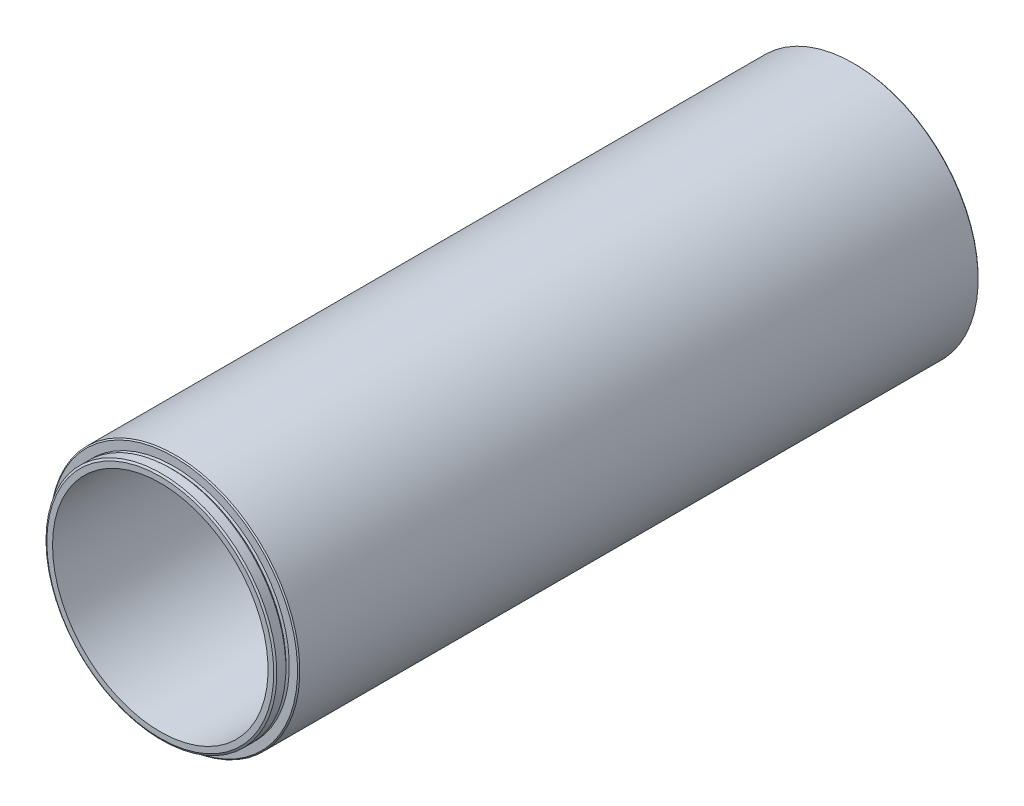
ISO-10303-21;
HEADER;
FILE_DESCRIPTION(('STEP AP214'),'2;1');
FILE_NAME('part.step','',(''),(''),'','','');
FILE_SCHEMA(('AUTOMOTIVE_DESIGN { 1 0 10303 214 1 1 1 1 }'));
ENDSEC;
DATA;
#1=APPLICATION_CONTEXT('core data for automotive mechanical design processes');
#2=APPLICATION_PROTOCOL_DEFINITION('international standard','automotive_design',2000,#1);
#3=PRODUCT_CONTEXT('',#1,'mechanical');
#4=PRODUCT('Part','Part','',(#3));
#5=PRODUCT_RELATED_PRODUCT_CATEGORY('part','',(#4));
#6=PRODUCT_DEFINITION_FORMATION('','',#4);
#7=PRODUCT_DEFINITION_CONTEXT('part definition',#1,'design');
#8=PRODUCT_DEFINITION('design','',#6,#7);
#9=PRODUCT_DEFINITION_SHAPE('','',#8);
#10=(LENGTH_UNIT() NAMED_UNIT(*) SI_UNIT(.MILLI.,.METRE.));
#11=(NAMED_UNIT(*) PLANE_ANGLE_UNIT() SI_UNIT($,.RADIAN.));
#12=(NAMED_UNIT(*) SI_UNIT($,.STERADIAN.) SOLID_ANGLE_UNIT());
#13=UNCERTAINTY_MEASURE_WITH_UNIT(LENGTH_MEASURE(1.E-05),#10,'distance_accuracy_value','');
#14=(GEOMETRIC_REPRESENTATION_CONTEXT(3) GLOBAL_UNCERTAINTY_ASSIGNED_CONTEXT((#13)) GLOBAL_UNIT_ASSIGNED_CONTEXT((#10,
#11,#12)) REPRESENTATION_CONTEXT('',''));
#15=CARTESIAN_POINT('',(0.,0.,0.));
#16=DIRECTION('',(0.,0.,1.));
#17=DIRECTION('',(1.,0.,0.));
#18=AXIS2_PLACEMENT_3D('',#15,#16,#17);
#19=CARTESIAN_POINT('',(-66.2576521581855,-31.9245145395257,134.37630402218));
#20=DIRECTION('',(0.,0.,-1.));
#21=DIRECTION('',(-1.,0.,0.));
#22=AXIS2_PLACEMENT_3D('',#19,#20,#21);
#23=CYLINDRICAL_SURFACE('',#22,25.8445);
#24=CARTESIAN_POINT('',(-66.2576521581855,-31.9245145395257,134.12230402218));
#25=DIRECTION('',(0.,0.,-1.));
#26=DIRECTION('',(-1.,0.,0.));
#27=AXIS2_PLACEMENT_3D('',#24,#25,#26);
#28=CIRCLE('',#27,25.8445);
#29=CARTESIAN_POINT('',(-92.1021521581855,-31.9245145395257,134.12230402218));
#30=VERTEX_POINT('',#29);
#31=EDGE_CURVE('P0_E10',#30,#30,#28,.T.);
#32=ORIENTED_EDGE('',*,*,#31,.T.);
#33=EDGE_LOOP('',(#32));
#34=FACE_BOUND('',#33,.T.);
#35=CARTESIAN_POINT('',(-66.2576521581855,-31.9245145395257,132.09030402218));
#36=DIRECTION('',(0.,0.,-1.));
#37=DIRECTION('',(-1.,0.,0.));
#38=AXIS2_PLACEMENT_3D('',#35,#36,#37);
#39=CIRCLE('',#38,25.8445);
#40=CARTESIAN_POINT('',(-92.1021521581855,-31.9245145395257,132.09030402218));
#41=VERTEX_POINT('',#40);
#42=EDGE_CURVE('P0_E80',#41,#41,#39,.T.);
#43=ORIENTED_EDGE('',*,*,#42,.F.);
#44=EDGE_LOOP('',(#43));
#45=FACE_BOUND('',#44,.T.);
#46=ADVANCED_FACE('P0_F31',(#34,#45),#23,.T.);
#47=CARTESIAN_POINT('',(-66.2576521581855,-31.9245145395257,134.12230402218));
#48=DIRECTION('',(0.,0.,-1.));
#49=DIRECTION('',(-1.,0.,0.));
#50=AXIS2_PLACEMENT_3D('',#47,#48,#49);
#51=CONICAL_SURFACE('',#50,25.8445,1.04719755119661);
#52=CARTESIAN_POINT('',(-66.2576521581855,-31.9245145395257,134.37630402218));
#53=DIRECTION('',(0.,0.,-1.));
#54=DIRECTION('',(-1.,0.,0.));
#55=AXIS2_PLACEMENT_3D('',#52,#53,#54);
#56=CIRCLE('',#55,25.4045590948775);
#57=CARTESIAN_POINT('',(-91.6622112530629,-31.9245145395257,134.37630402218));
#58=VERTEX_POINT('',#57);
#59=EDGE_CURVE('P0_E37',#58,#58,#56,.T.);
#60=ORIENTED_EDGE('',*,*,#59,.T.);
#61=EDGE_LOOP('',(#60));
#62=FACE_BOUND('',#61,.T.);
#63=ORIENTED_EDGE('',*,*,#31,.F.);
#64=EDGE_LOOP('',(#63));
#65=FACE_BOUND('',#64,.T.);
#66=ADVANCED_FACE('P0_F88',(#62,#65),#51,.T.);
#67=CARTESIAN_POINT('',(-40.853093063308,-31.9245145395257,134.37630402218));
#68=DIRECTION('',(0.,0.,1.));
#69=DIRECTION('',(1.,0.,0.));
#70=AXIS2_PLACEMENT_3D('',#67,#68,#69);
#71=PLANE('',#70);
#72=CARTESIAN_POINT('',(-66.2576521581855,-31.9245145395257,134.37630402218));
#73=DIRECTION('',(0.,0.,-1.));
#74=DIRECTION('',(-1.,0.,0.));
#75=AXIS2_PLACEMENT_3D('',#72,#73,#74);
#76=CIRCLE('',#75,24.13);
#77=CARTESIAN_POINT('',(-90.3876521581855,-31.9245145395257,134.37630402218));
#78=VERTEX_POINT('',#77);
#79=EDGE_CURVE('P0_E41',#78,#78,#76,.T.);
#80=ORIENTED_EDGE('',*,*,#79,.T.);
#81=EDGE_LOOP('',(#80));
#82=FACE_BOUND('',#81,.T.);
#83=ORIENTED_EDGE('',*,*,#59,.F.);
#84=EDGE_LOOP('',(#83));
#85=FACE_BOUND('',#84,.T.);
#86=ADVANCED_FACE('P0_F92',(#82,#85),#71,.T.);
#87=CARTESIAN_POINT('',(-66.2576521581855,-31.9245145395257,134.37630402218));
#88=DIRECTION('',(0.,0.,-1.));
#89=DIRECTION('',(-1.,0.,0.));
#90=AXIS2_PLACEMENT_3D('',#87,#88,#89);
#91=CYLINDRICAL_SURFACE('',#90,24.13);
#92=CARTESIAN_POINT('',(-66.2576521581855,-31.9245145395257,4.3283040221796));
#93=DIRECTION('',(0.,0.,-1.));
#94=DIRECTION('',(-1.,0.,0.));
#95=AXIS2_PLACEMENT_3D('',#92,#93,#94);
#96=CIRCLE('',#95,24.13);
#97=CARTESIAN_POINT('',(-90.3876521581855,-31.9245145395257,4.3283040221796));
#98=VERTEX_POINT('',#97);
#99=EDGE_CURVE('P0_E45',#98,#98,#96,.T.);
#100=ORIENTED_EDGE('',*,*,#99,.T.);
#101=EDGE_LOOP('',(#100));
#102=FACE_BOUND('',#101,.T.);
#103=ORIENTED_EDGE('',*,*,#79,.F.);
#104=EDGE_LOOP('',(#103));
#105=FACE_BOUND('',#104,.T.);
#106=ADVANCED_FACE('P0_F96',(#102,#105),#91,.F.);
#107=CARTESIAN_POINT('',(-42.1276521581855,-31.9245145395257,4.32830402217959));
#108=DIRECTION('',(0.,0.,-1.));
#109=DIRECTION('',(-1.,0.,0.));
#110=AXIS2_PLACEMENT_3D('',#107,#108,#109);
#111=PLANE('',#110);
#112=CARTESIAN_POINT('',(-66.2576521581855,-31.9245145395257,4.32830402217957));
#113=DIRECTION('',(0.,0.,-1.));
#114=DIRECTION('',(-1.,0.,0.));
#115=AXIS2_PLACEMENT_3D('',#112,#113,#114);
#116=CIRCLE('',#115,25.8445);
#117=CARTESIAN_POINT('',(-92.1021521581855,-31.9245145395257,4.32830402217957));
#118=VERTEX_POINT('',#117);
#119=EDGE_CURVE('P0_E50',#118,#118,#116,.T.);
#120=ORIENTED_EDGE('',*,*,#119,.T.);
#121=EDGE_LOOP('',(#120));
#122=FACE_BOUND('',#121,.T.);
#123=ORIENTED_EDGE('',*,*,#99,.F.);
#124=EDGE_LOOP('',(#123));
#125=FACE_BOUND('',#124,.T.);
#126=ADVANCED_FACE('P0_F103',(#122,#125),#111,.T.);
#127=CARTESIAN_POINT('',(-66.2576521581855,-31.9245145395257,134.37630402218));
#128=DIRECTION('',(0.,0.,-1.));
#129=DIRECTION('',(-1.,0.,0.));
#130=AXIS2_PLACEMENT_3D('',#127,#128,#129);
#131=CYLINDRICAL_SURFACE('',#130,25.8445);
#132=CARTESIAN_POINT('',(-66.2576521581855,-31.9245145395257,-20.6317550726979));
#133=DIRECTION('',(0.,0.,-1.));
#134=DIRECTION('',(-1.,0.,0.));
#135=AXIS2_PLACEMENT_3D('',#132,#133,#134);
#136=CIRCLE('',#135,25.8445);
#137=CARTESIAN_POINT('',(-92.1021521581855,-31.9245145395257,-20.6317550726979));
#138=VERTEX_POINT('',#137);
#139=EDGE_CURVE('P0_E53',#138,#138,#136,.T.);
#140=ORIENTED_EDGE('',*,*,#139,.T.);
#141=EDGE_LOOP('',(#140));
#142=FACE_BOUND('',#141,.T.);
#143=ORIENTED_EDGE('',*,*,#119,.F.);
#144=EDGE_LOOP('',(#143));
#145=FACE_BOUND('',#144,.T.);
#146=ADVANCED_FACE('P0_F107',(#142,#145),#131,.F.);
#147=CARTESIAN_POINT('',(-66.2576521581855,-31.9245145395257,-20.6317550726979));
#148=DIRECTION('',(0.,0.,-1.));
#149=DIRECTION('',(-1.,0.,0.));
#150=AXIS2_PLACEMENT_3D('',#147,#148,#149);
#151=CONICAL_SURFACE('',#150,25.8445,0.523598775598285);
#152=CARTESIAN_POINT('',(-66.2576521581855,-31.9245145395257,-21.0716959778204));
#153=DIRECTION('',(0.,0.,-1.));
#154=DIRECTION('',(-1.,0.,0.));
#155=AXIS2_PLACEMENT_3D('',#152,#153,#154);
#156=CIRCLE('',#155,26.0985);
#157=CARTESIAN_POINT('',(-92.3561521581855,-31.9245145395257,-21.0716959778204));
#158=VERTEX_POINT('',#157);
#159=EDGE_CURVE('P0_E56',#158,#158,#156,.T.);
#160=ORIENTED_EDGE('',*,*,#159,.T.);
#161=EDGE_LOOP('',(#160));
#162=FACE_BOUND('',#161,.T.);
#163=ORIENTED_EDGE('',*,*,#139,.F.);
#164=EDGE_LOOP('',(#163));
#165=FACE_BOUND('',#164,.T.);
#166=ADVANCED_FACE('P0_F111',(#162,#165),#151,.F.);
#167=CARTESIAN_POINT('',(-40.1591521581855,-31.9245145395257,-21.0716959778204));
#168=DIRECTION('',(0.,0.,-1.));
#169=DIRECTION('',(-1.,0.,0.));
#170=AXIS2_PLACEMENT_3D('',#167,#168,#169);
#171=PLANE('',#170);
#172=CARTESIAN_POINT('',(-66.2576521581855,-31.9245145395257,-21.0716959778204));
#173=DIRECTION('',(0.,0.,-1.));
#174=DIRECTION('',(-1.,0.,0.));
#175=AXIS2_PLACEMENT_3D('',#172,#173,#174);
#176=CIRCLE('',#175,27.686);
#177=CARTESIAN_POINT('',(-93.9436521581855,-31.9245145395257,-21.0716959778204));
#178=VERTEX_POINT('',#177);
#179=EDGE_CURVE('P0_E59',#178,#178,#176,.T.);
#180=ORIENTED_EDGE('',*,*,#179,.T.);
#181=EDGE_LOOP('',(#180));
#182=FACE_BOUND('',#181,.T.);
#183=ORIENTED_EDGE('',*,*,#159,.F.);
#184=EDGE_LOOP('',(#183));
#185=FACE_BOUND('',#184,.T.);
#186=ADVANCED_FACE('P0_F115',(#182,#185),#171,.T.);
#187=CARTESIAN_POINT('',(-66.2576521581855,-31.9245145395257,-21.0716959778204));
#188=DIRECTION('',(0.,0.,1.));
#189=DIRECTION('',(1.,0.,0.));
#190=AXIS2_PLACEMENT_3D('',#187,#188,#189);
#191=CONICAL_SURFACE('',#190,27.686,0.78539816339753);
#192=CARTESIAN_POINT('',(-66.2576521581855,-31.9245145395257,-20.8176959778204));
#193=DIRECTION('',(0.,0.,-1.));
#194=DIRECTION('',(-1.,0.,0.));
#195=AXIS2_PLACEMENT_3D('',#192,#193,#194);
#196=CIRCLE('',#195,27.94);
#197=CARTESIAN_POINT('',(-94.1976521581855,-31.9245145395257,-20.8176959778204));
#198=VERTEX_POINT('',#197);
#199=EDGE_CURVE('P0_E62',#198,#198,#196,.T.);
#200=ORIENTED_EDGE('',*,*,#199,.T.);
#201=EDGE_LOOP('',(#200));
#202=FACE_BOUND('',#201,.T.);
#203=ORIENTED_EDGE('',*,*,#179,.F.);
#204=EDGE_LOOP('',(#203));
#205=FACE_BOUND('',#204,.T.);
#206=ADVANCED_FACE('P0_F119',(#202,#205),#191,.T.);
#207=CARTESIAN_POINT('',(-66.2576521581855,-31.9245145395257,134.37630402218));
#208=DIRECTION('',(0.,0.,-1.));
#209=DIRECTION('',(-1.,0.,0.));
#210=AXIS2_PLACEMENT_3D('',#207,#208,#209);
#211=CYLINDRICAL_SURFACE('',#210,27.94);
#212=CARTESIAN_POINT('',(-66.2576521581855,-31.9245145395257,131.07430402218));
#213=DIRECTION('',(0.,0.,-1.));
#214=DIRECTION('',(-1.,0.,0.));
#215=AXIS2_PLACEMENT_3D('',#212,#213,#214);
#216=CIRCLE('',#215,27.94);
#217=CARTESIAN_POINT('',(-94.1976521581855,-31.9245145395257,131.07430402218));
#218=VERTEX_POINT('',#217);
#219=EDGE_CURVE('P0_E65',#218,#218,#216,.T.);
#220=ORIENTED_EDGE('',*,*,#219,.T.);
#221=EDGE_LOOP('',(#220));
#222=FACE_BOUND('',#221,.T.);
#223=ORIENTED_EDGE('',*,*,#199,.F.);
#224=EDGE_LOOP('',(#223));
#225=FACE_BOUND('',#224,.T.);
#226=ADVANCED_FACE('P0_F123',(#222,#225),#211,.T.);
#227=CARTESIAN_POINT('',(-66.2576521581855,-31.9245145395257,131.07430402218));
#228=DIRECTION('',(0.,0.,-1.));
#229=DIRECTION('',(-1.,0.,0.));
#230=AXIS2_PLACEMENT_3D('',#227,#228,#229);
#231=CONICAL_SURFACE('',#230,27.94,0.785398163397435);
#232=CARTESIAN_POINT('',(-66.2576521581855,-31.9245145395257,131.32830402218));
#233=DIRECTION('',(0.,0.,-1.));
#234=DIRECTION('',(-1.,0.,0.));
#235=AXIS2_PLACEMENT_3D('',#232,#233,#234);
#236=CIRCLE('',#235,27.686);
#237=CARTESIAN_POINT('',(-93.9436521581855,-31.9245145395257,131.32830402218));
#238=VERTEX_POINT('',#237);
#239=EDGE_CURVE('P0_E68',#238,#238,#236,.T.);
#240=ORIENTED_EDGE('',*,*,#239,.T.);
#241=EDGE_LOOP('',(#240));
#242=FACE_BOUND('',#241,.T.);
#243=ORIENTED_EDGE('',*,*,#219,.F.);
#244=EDGE_LOOP('',(#243));
#245=FACE_BOUND('',#244,.T.);
#246=ADVANCED_FACE('P0_F127',(#242,#245),#231,.T.);
#247=CARTESIAN_POINT('',(-38.5716521581855,-31.9245145395257,131.32830402218));
#248=DIRECTION('',(0.,0.,1.));
#249=DIRECTION('',(1.,0.,0.));
#250=AXIS2_PLACEMENT_3D('',#247,#248,#249);
#251=PLANE('',#250);
#252=CARTESIAN_POINT('',(-66.2576521581855,-31.9245145395257,131.32830402218));
#253=DIRECTION('',(0.,0.,-1.));
#254=DIRECTION('',(-1.,0.,0.));
#255=AXIS2_PLACEMENT_3D('',#252,#253,#254);
#256=CIRCLE('',#255,25.8445);
#257=CARTESIAN_POINT('',(-92.1021521581855,-31.9245145395257,131.32830402218));
#258=VERTEX_POINT('',#257);
#259=EDGE_CURVE('P0_E71',#258,#258,#256,.T.);
#260=ORIENTED_EDGE('',*,*,#259,.T.);
#261=EDGE_LOOP('',(#260));
#262=FACE_BOUND('',#261,.T.);
#263=ORIENTED_EDGE('',*,*,#239,.F.);
#264=EDGE_LOOP('',(#263));
#265=FACE_BOUND('',#264,.T.);
#266=ADVANCED_FACE('P0_F131',(#262,#265),#251,.T.);
#267=CARTESIAN_POINT('',(-66.2576521581855,-31.9245145395257,131.32830402218));
#268=DIRECTION('',(0.,0.,-1.));
#269=DIRECTION('',(-1.,0.,0.));
#270=AXIS2_PLACEMENT_3D('',#267,#268,#269);
#271=CONICAL_SURFACE('',#270,25.8445,1.04719755119658);
#272=CARTESIAN_POINT('',(-66.2576521581855,-31.9245145395257,131.592268565253));
#273=DIRECTION('',(0.,0.,-1.));
#274=DIRECTION('',(-1.,0.,0.));
#275=AXIS2_PLACEMENT_3D('',#272,#273,#274);
#276=CIRCLE('',#275,25.3873);
#277=CARTESIAN_POINT('',(-91.6449521581855,-31.9245145395257,131.592268565253));
#278=VERTEX_POINT('',#277);
#279=EDGE_CURVE('P0_E74',#278,#278,#276,.T.);
#280=ORIENTED_EDGE('',*,*,#279,.T.);
#281=EDGE_LOOP('',(#280));
#282=FACE_BOUND('',#281,.T.);
#283=ORIENTED_EDGE('',*,*,#259,.F.);
#284=EDGE_LOOP('',(#283));
#285=FACE_BOUND('',#284,.T.);
#286=ADVANCED_FACE('P0_F135',(#282,#285),#271,.T.);
#287=CARTESIAN_POINT('',(-66.2576521581855,-31.9245145395257,134.37630402218));
#288=DIRECTION('',(0.,0.,-1.));
#289=DIRECTION('',(-1.,0.,0.));
#290=AXIS2_PLACEMENT_3D('',#287,#288,#289);
#291=CYLINDRICAL_SURFACE('',#290,25.3873);
#292=CARTESIAN_POINT('',(-66.2576521581855,-31.9245145395257,131.826339479106));
#293=DIRECTION('',(0.,0.,-1.));
#294=DIRECTION('',(-1.,0.,0.));
#295=AXIS2_PLACEMENT_3D('',#292,#293,#294);
#296=CIRCLE('',#295,25.3873);
#297=CARTESIAN_POINT('',(-91.6449521581855,-31.9245145395257,131.826339479106));
#298=VERTEX_POINT('',#297);
#299=EDGE_CURVE('P0_E77',#298,#298,#296,.T.);
#300=ORIENTED_EDGE('',*,*,#299,.T.);
#301=EDGE_LOOP('',(#300));
#302=FACE_BOUND('',#301,.T.);
#303=ORIENTED_EDGE('',*,*,#279,.F.);
#304=EDGE_LOOP('',(#303));
#305=FACE_BOUND('',#304,.T.);
#306=ADVANCED_FACE('P0_F139',(#302,#305),#291,.T.);
#307=CARTESIAN_POINT('',(-66.2576521581855,-31.9245145395257,131.826339479106));
#308=DIRECTION('',(0.,0.,1.));
#309=DIRECTION('',(1.,0.,0.));
#310=AXIS2_PLACEMENT_3D('',#307,#308,#309);
#311=CONICAL_SURFACE('',#310,25.3873,1.04719755119657);
#312=ORIENTED_EDGE('',*,*,#42,.T.);
#313=EDGE_LOOP('',(#312));
#314=FACE_BOUND('',#313,.T.);
#315=ORIENTED_EDGE('',*,*,#299,.F.);
#316=EDGE_LOOP('',(#315));
#317=FACE_BOUND('',#316,.T.);
#318=ADVANCED_FACE('P0_F84',(#314,#317),#311,.T.);
#319=CLOSED_SHELL('',(#46,#66,#86,#106,#126,#146,#166,#186,#206,#226,#246,#266,#286,#306,#318));
#320=MANIFOLD_SOLID_BREP('P0_B2',#319);
#321=CARTESIAN_POINT('',(-66.2576521581855,-31.9245145395257,-21.0716959778204));
#322=DIRECTION('',(0.,0.,-1.));
#323=DIRECTION('',(0.,-1.,0.));
#324=AXIS2_PLACEMENT_3D('',#321,#322,#323);
#325=PLANE('',#324);
#326=DIRECTION('',(1.,0.,0.));
#327=VECTOR('',#326,1.);
#328=CARTESIAN_POINT('',(-94.9888902812954,-31.5435145395257,-21.0716959778204));
#329=LINE('',#328,#327);
#330=CARTESIAN_POINT('',(-41.8766289023826,-31.5435145395257,-21.0716959778204));
#331=VERTEX_POINT('',#330);
#332=CARTESIAN_POINT('',(-40.6699885436621,-31.5435145395257,-21.0716959778204));
#333=VERTEX_POINT('',#332);
#334=EDGE_CURVE('P1_E263',#331,#333,#329,.T.);
#335=ORIENTED_EDGE('',*,*,#334,.F.);
#336=CARTESIAN_POINT('',(-66.2576521581855,-31.9245145395257,-21.0716959778204));
#337=DIRECTION('',(0.,0.,-1.));
#338=DIRECTION('',(0.,-1.,0.));
#339=AXIS2_PLACEMENT_3D('',#336,#337,#338);
#340=CIRCLE('',#339,24.384);
#341=CARTESIAN_POINT('',(-90.6386754139884,-31.5435145395257,-21.0716959778204));
#342=VERTEX_POINT('',#341);
#343=EDGE_CURVE('P1_E220',#331,#342,#340,.F.);
#344=ORIENTED_EDGE('',*,*,#343,.T.);
#345=CARTESIAN_POINT('',(-91.8453157727088,-31.5435145395257,-21.0716959778204));
#346=VERTEX_POINT('',#345);
#347=EDGE_CURVE('P1_E262',#346,#342,#329,.T.);
#348=ORIENTED_EDGE('',*,*,#347,.F.);
#349=CARTESIAN_POINT('',(-66.2576521581855,-31.9245145395257,-21.0716959778204));
#350=DIRECTION('',(0.,0.,-1.));
#351=DIRECTION('',(0.,-1.,0.));
#352=AXIS2_PLACEMENT_3D('',#349,#350,#351);
#353=CIRCLE('',#352,25.5905);
#354=EDGE_CURVE('P1_E273',#346,#333,#353,.T.);
#355=ORIENTED_EDGE('',*,*,#354,.T.);
#356=EDGE_LOOP('',(#335,#344,#348,#355));
#357=FACE_BOUND('',#356,.T.);
#358=ADVANCED_FACE('P1_F16',(#357),#325,.T.);
#359=DIRECTION('',(-1.,0.,0.));
#360=VECTOR('',#359,1.);
#361=CARTESIAN_POINT('',(-94.9888902812954,-32.3055145395257,-21.0716959778204));
#362=LINE('',#361,#360);
#363=CARTESIAN_POINT('',(-90.6386754139884,-32.3055145395257,-21.0716959778204));
#364=VERTEX_POINT('',#363);
#365=CARTESIAN_POINT('',(-91.8453157727088,-32.3055145395257,-21.0716959778204));
#366=VERTEX_POINT('',#365);
#367=EDGE_CURVE('P1_E259',#364,#366,#362,.T.);
#368=ORIENTED_EDGE('',*,*,#367,.F.);
#369=CARTESIAN_POINT('',(-66.2576521581855,-31.9245145395257,-21.0716959778204));
#370=DIRECTION('',(0.,0.,-1.));
#371=DIRECTION('',(0.,-1.,0.));
#372=AXIS2_PLACEMENT_3D('',#369,#370,#371);
#373=CIRCLE('',#372,24.384);
#374=CARTESIAN_POINT('',(-41.8766289023826,-32.3055145395257,-21.0716959778204));
#375=VERTEX_POINT('',#374);
#376=EDGE_CURVE('P1_E37',#364,#375,#373,.F.);
#377=ORIENTED_EDGE('',*,*,#376,.T.);
#378=CARTESIAN_POINT('',(-40.6699885436621,-32.3055145395257,-21.0716959778204));
#379=VERTEX_POINT('',#378);
#380=EDGE_CURVE('P1_E145',#379,#375,#362,.T.);
#381=ORIENTED_EDGE('',*,*,#380,.F.);
#382=CARTESIAN_POINT('',(-66.2576521581855,-31.9245145395257,-21.0716959778204));
#383=DIRECTION('',(0.,0.,-1.));
#384=DIRECTION('',(0.,-1.,0.));
#385=AXIS2_PLACEMENT_3D('',#382,#383,#384);
#386=CIRCLE('',#385,25.5905);
#387=EDGE_CURVE('P1_E250',#379,#366,#386,.T.);
#388=ORIENTED_EDGE('',*,*,#387,.T.);
#389=EDGE_LOOP('',(#368,#377,#381,#388));
#390=FACE_BOUND('',#389,.T.);
#391=ADVANCED_FACE('P1_F258',(#390),#325,.T.);
#392=CARTESIAN_POINT('',(-66.2576521581855,-31.9245145395257,-18.5316959778204));
#393=DIRECTION('',(0.,0.,-1.));
#394=DIRECTION('',(0.,-1.,0.));
#395=AXIS2_PLACEMENT_3D('',#392,#393,#394);
#396=PLANE('',#395);
#397=CARTESIAN_POINT('',(-66.2576521581855,-31.9245145395257,-18.5316959778204));
#398=DIRECTION('',(0.,0.,-1.));
#399=DIRECTION('',(0.,-1.,0.));
#400=AXIS2_PLACEMENT_3D('',#397,#398,#399);
#401=CIRCLE('',#400,24.384);
#402=CARTESIAN_POINT('',(-66.2576521581855,-56.3085145395257,-18.5316959778204));
#403=VERTEX_POINT('',#402);
#404=EDGE_CURVE('P1_E169',#403,#403,#401,.T.);
#405=ORIENTED_EDGE('',*,*,#404,.T.);
#406=EDGE_LOOP('',(#405));
#407=FACE_BOUND('',#406,.T.);
#408=CARTESIAN_POINT('',(-66.2576521581855,-31.9245145395257,-18.5316959778204));
#409=DIRECTION('',(0.,0.,-1.));
#410=DIRECTION('',(0.,-1.,0.));
#411=AXIS2_PLACEMENT_3D('',#408,#409,#410);
#412=CIRCLE('',#411,25.5905);
#413=CARTESIAN_POINT('',(-66.2576521581855,-57.5150145395257,-18.5316959778204));
#414=VERTEX_POINT('',#413);
#415=EDGE_CURVE('P1_E166',#414,#414,#412,.F.);
#416=ORIENTED_EDGE('',*,*,#415,.T.);
#417=EDGE_LOOP('',(#416));
#418=FACE_BOUND('',#417,.T.);
#419=ADVANCED_FACE('P1_F290',(#407,#418),#396,.F.);
#420=CARTESIAN_POINT('',(-66.2576521581855,-31.9245145395257,-21.0716959778204));
#421=DIRECTION('',(0.,0.,1.));
#422=DIRECTION('',(0.,1.,0.));
#423=AXIS2_PLACEMENT_3D('',#420,#421,#422);
#424=CYLINDRICAL_SURFACE('',#423,25.8445);
#425=CARTESIAN_POINT('',(-66.2576521581855,-31.9245145395257,-18.7856959778204));
#426=DIRECTION('',(0.,0.,-1.));
#427=DIRECTION('',(0.,-1.,0.));
#428=AXIS2_PLACEMENT_3D('',#425,#426,#427);
#429=CIRCLE('',#428,25.8445);
#430=CARTESIAN_POINT('',(-66.2576521581855,-57.7690145395257,-18.7856959778204));
#431=VERTEX_POINT('',#430);
#432=EDGE_CURVE('P1_E184',#431,#431,#429,.T.);
#433=ORIENTED_EDGE('',*,*,#432,.T.);
#434=EDGE_LOOP('',(#433));
#435=FACE_BOUND('',#434,.T.);
#436=DIRECTION('',(0.,0.,1.));
#437=VECTOR('',#436,1.);
#438=CARTESIAN_POINT('',(-92.0993436517778,-32.3055145395257,-21.0716959778204));
#439=LINE('',#438,#437);
#440=CARTESIAN_POINT('',(-92.0993436517778,-32.3055145395257,-20.4366959778204));
#441=VERTEX_POINT('',#440);
#442=CARTESIAN_POINT('',(-92.0993436517778,-32.3055145395257,-20.8176959778204));
#443=VERTEX_POINT('',#442);
#444=EDGE_CURVE('P1_E133',#441,#443,#439,.F.);
#445=ORIENTED_EDGE('',*,*,#444,.T.);
#446=CARTESIAN_POINT('',(-66.2576521581855,-31.9245145395257,-20.8176959778204));
#447=DIRECTION('',(0.,0.,-1.));
#448=DIRECTION('',(0.,-1.,0.));
#449=AXIS2_PLACEMENT_3D('',#446,#447,#448);
#450=CIRCLE('',#449,25.8445);
#451=CARTESIAN_POINT('',(-40.4159606645932,-32.3055145395257,-20.8176959778204));
#452=VERTEX_POINT('',#451);
#453=EDGE_CURVE('P1_E182',#443,#452,#450,.F.);
#454=ORIENTED_EDGE('',*,*,#453,.T.);
#455=DIRECTION('',(0.,0.,1.));
#456=VECTOR('',#455,1.);
#457=CARTESIAN_POINT('',(-40.4159606645932,-32.3055145395257,-21.0716959778204));
#458=LINE('',#457,#456);
#459=CARTESIAN_POINT('',(-40.4159606645932,-32.3055145395257,-20.4366959778204));
#460=VERTEX_POINT('',#459);
#461=EDGE_CURVE('P1_E151',#452,#460,#458,.T.);
#462=ORIENTED_EDGE('',*,*,#461,.T.);
#463=CARTESIAN_POINT('',(-66.2576521581855,-31.9245145395257,-20.4366959778204));
#464=DIRECTION('',(0.,0.,-1.));
#465=DIRECTION('',(0.,-1.,0.));
#466=AXIS2_PLACEMENT_3D('',#463,#464,#465);
#467=CIRCLE('',#466,25.8445);
#468=CARTESIAN_POINT('',(-40.4159606645932,-31.5435145395257,-20.4366959778204));
#469=VERTEX_POINT('',#468);
#470=EDGE_CURVE('P1_E134',#469,#460,#467,.T.);
#471=ORIENTED_EDGE('',*,*,#470,.F.);
#472=DIRECTION('',(0.,0.,1.));
#473=VECTOR('',#472,1.);
#474=CARTESIAN_POINT('',(-40.4159606645932,-31.5435145395257,-21.0716959778204));
#475=LINE('',#474,#473);
#476=CARTESIAN_POINT('',(-40.4159606645932,-31.5435145395257,-20.8176959778204));
#477=VERTEX_POINT('',#476);
#478=EDGE_CURVE('P1_E123',#469,#477,#475,.F.);
#479=ORIENTED_EDGE('',*,*,#478,.T.);
#480=CARTESIAN_POINT('',(-66.2576521581855,-31.9245145395257,-20.8176959778204));
#481=DIRECTION('',(0.,0.,-1.));
#482=DIRECTION('',(0.,-1.,0.));
#483=AXIS2_PLACEMENT_3D('',#480,#481,#482);
#484=CIRCLE('',#483,25.8445);
#485=CARTESIAN_POINT('',(-92.0993436517778,-31.5435145395257,-20.8176959778204));
#486=VERTEX_POINT('',#485);
#487=EDGE_CURVE('P1_E118',#477,#486,#484,.F.);
#488=ORIENTED_EDGE('',*,*,#487,.T.);
#489=DIRECTION('',(0.,0.,1.));
#490=VECTOR('',#489,1.);
#491=CARTESIAN_POINT('',(-92.0993436517778,-31.5435145395257,-21.0716959778204));
#492=LINE('',#491,#490);
#493=CARTESIAN_POINT('',(-92.0993436517778,-31.5435145395257,-20.4366959778204));
#494=VERTEX_POINT('',#493);
#495=EDGE_CURVE('P1_E111',#486,#494,#492,.T.);
#496=ORIENTED_EDGE('',*,*,#495,.T.);
#497=EDGE_CURVE('P1_E115',#441,#494,#467,.T.);
#498=ORIENTED_EDGE('',*,*,#497,.F.);
#499=EDGE_LOOP('',(#445,#454,#462,#471,#479,#488,#496,#498));
#500=FACE_BOUND('',#499,.T.);
#501=ADVANCED_FACE('P1_F114',(#435,#500),#424,.T.);
#502=CARTESIAN_POINT('',(-66.2576521581855,-31.9245145395257,-21.0716959778204));
#503=DIRECTION('',(0.,0.,1.));
#504=DIRECTION('',(0.,1.,0.));
#505=AXIS2_PLACEMENT_3D('',#502,#503,#504);
#506=CYLINDRICAL_SURFACE('',#505,24.13);
#507=CARTESIAN_POINT('',(-66.2576521581855,-31.9245145395257,-18.7856959778204));
#508=DIRECTION('',(0.,0.,-1.));
#509=DIRECTION('',(0.,-1.,0.));
#510=AXIS2_PLACEMENT_3D('',#507,#508,#509);
#511=CIRCLE('',#510,24.13);
#512=CARTESIAN_POINT('',(-66.2576521581855,-56.0545145395257,-18.7856959778204));
#513=VERTEX_POINT('',#512);
#514=EDGE_CURVE('P1_E178',#513,#513,#511,.F.);
#515=ORIENTED_EDGE('',*,*,#514,.T.);
#516=EDGE_LOOP('',(#515));
#517=FACE_BOUND('',#516,.T.);
#518=DIRECTION('',(0.,0.,1.));
#519=VECTOR('',#518,1.);
#520=CARTESIAN_POINT('',(-90.3846440759526,-31.5435145395257,-21.0716959778204));
#521=LINE('',#520,#519);
#522=CARTESIAN_POINT('',(-90.3846440759526,-31.5435145395257,-20.8176959778204));
#523=VERTEX_POINT('',#522);
#524=CARTESIAN_POINT('',(-90.3846440759526,-31.5435145395257,-20.4366959778204));
#525=VERTEX_POINT('',#524);
#526=EDGE_CURVE('P1_E139',#523,#525,#521,.T.);
#527=ORIENTED_EDGE('',*,*,#526,.F.);
#528=CARTESIAN_POINT('',(-66.2576521581855,-31.9245145395257,-20.8176959778204));
#529=DIRECTION('',(0.,0.,-1.));
#530=DIRECTION('',(0.,-1.,0.));
#531=AXIS2_PLACEMENT_3D('',#528,#529,#530);
#532=CIRCLE('',#531,24.13);
#533=CARTESIAN_POINT('',(-42.1306602404183,-31.5435145395257,-20.8176959778204));
#534=VERTEX_POINT('',#533);
#535=EDGE_CURVE('P1_E175',#523,#534,#532,.T.);
#536=ORIENTED_EDGE('',*,*,#535,.T.);
#537=DIRECTION('',(0.,0.,1.));
#538=VECTOR('',#537,1.);
#539=CARTESIAN_POINT('',(-42.1306602404183,-31.5435145395257,-21.0716959778204));
#540=LINE('',#539,#538);
#541=CARTESIAN_POINT('',(-42.1306602404183,-31.5435145395257,-20.4366959778204));
#542=VERTEX_POINT('',#541);
#543=EDGE_CURVE('P1_E159',#542,#534,#540,.F.);
#544=ORIENTED_EDGE('',*,*,#543,.F.);
#545=CARTESIAN_POINT('',(-66.2576521581855,-31.9245145395257,-20.4366959778204));
#546=DIRECTION('',(0.,0.,-1.));
#547=DIRECTION('',(0.,-1.,0.));
#548=AXIS2_PLACEMENT_3D('',#545,#546,#547);
#549=CIRCLE('',#548,24.13);
#550=CARTESIAN_POINT('',(-42.1306602404183,-32.3055145395257,-20.4366959778204));
#551=VERTEX_POINT('',#550);
#552=EDGE_CURVE('P1_E122',#542,#551,#549,.T.);
#553=ORIENTED_EDGE('',*,*,#552,.T.);
#554=DIRECTION('',(0.,0.,1.));
#555=VECTOR('',#554,1.);
#556=CARTESIAN_POINT('',(-42.1306602404183,-32.3055145395257,-21.0716959778204));
#557=LINE('',#556,#555);
#558=CARTESIAN_POINT('',(-42.1306602404183,-32.3055145395257,-20.8176959778204));
#559=VERTEX_POINT('',#558);
#560=EDGE_CURVE('P1_E156',#559,#551,#557,.T.);
#561=ORIENTED_EDGE('',*,*,#560,.F.);
#562=CARTESIAN_POINT('',(-66.2576521581855,-31.9245145395257,-20.8176959778204));
#563=DIRECTION('',(0.,0.,-1.));
#564=DIRECTION('',(0.,-1.,0.));
#565=AXIS2_PLACEMENT_3D('',#562,#563,#564);
#566=CIRCLE('',#565,24.13);
#567=CARTESIAN_POINT('',(-90.3846440759526,-32.3055145395257,-20.8176959778204));
#568=VERTEX_POINT('',#567);
#569=EDGE_CURVE('P1_E172',#559,#568,#566,.T.);
#570=ORIENTED_EDGE('',*,*,#569,.T.);
#571=DIRECTION('',(0.,0.,1.));
#572=VECTOR('',#571,1.);
#573=CARTESIAN_POINT('',(-90.3846440759526,-32.3055145395257,-21.0716959778204));
#574=LINE('',#573,#572);
#575=CARTESIAN_POINT('',(-90.3846440759526,-32.3055145395257,-20.4366959778204));
#576=VERTEX_POINT('',#575);
#577=EDGE_CURVE('P1_E162',#576,#568,#574,.F.);
#578=ORIENTED_EDGE('',*,*,#577,.F.);
#579=EDGE_CURVE('P1_E157',#576,#525,#549,.T.);
#580=ORIENTED_EDGE('',*,*,#579,.T.);
#581=EDGE_LOOP('',(#527,#536,#544,#553,#561,#570,#578,#580));
#582=FACE_BOUND('',#581,.T.);
#583=ADVANCED_FACE('P1_F207',(#517,#582),#506,.F.);
#584=CARTESIAN_POINT('',(-36.2691912600617,-31.5435145395257,-20.4366959778204));
#585=DIRECTION('',(0.,0.,-1.));
#586=DIRECTION('',(0.,-1.,0.));
#587=AXIS2_PLACEMENT_3D('',#584,#585,#586);
#588=PLANE('',#587);
#589=ORIENTED_EDGE('',*,*,#470,.T.);
#590=DIRECTION('',(-1.,0.,0.));
#591=VECTOR('',#590,1.);
#592=CARTESIAN_POINT('',(-94.9888902812954,-32.3055145395257,-20.4366959778204));
#593=LINE('',#592,#591);
#594=EDGE_CURVE('P1_E142',#460,#551,#593,.T.);
#595=ORIENTED_EDGE('',*,*,#594,.T.);
#596=ORIENTED_EDGE('',*,*,#552,.F.);
#597=DIRECTION('',(1.,0.,0.));
#598=VECTOR('',#597,1.);
#599=CARTESIAN_POINT('',(-94.9888902812954,-31.5435145395257,-20.4366959778204));
#600=LINE('',#599,#598);
#601=EDGE_CURVE('P1_E140',#542,#469,#600,.T.);
#602=ORIENTED_EDGE('',*,*,#601,.T.);
#603=EDGE_LOOP('',(#589,#595,#596,#602));
#604=FACE_BOUND('',#603,.T.);
#605=ADVANCED_FACE('P1_F302',(#604),#588,.T.);
#606=CARTESIAN_POINT('',(-94.9888902812954,-32.3055145395257,-20.4366959778204));
#607=DIRECTION('',(0.,-1.,0.));
#608=DIRECTION('',(-1.,0.,0.));
#609=AXIS2_PLACEMENT_3D('',#606,#607,#608);
#610=PLANE('',#609);
#611=ORIENTED_EDGE('',*,*,#380,.T.);
#612=CARTESIAN_POINT('',(-41.8766289023826,-32.3055145395257,-21.0716959778204));
#613=CARTESIAN_POINT('',(-41.9189674313746,-32.3055145395257,-21.0293626171364));
#614=CARTESIAN_POINT('',(-41.9613059740403,-32.3055145395257,-20.9870292701278));
#615=CARTESIAN_POINT('',(-42.0459830867189,-32.3055145395257,-20.9023626034611));
#616=CARTESIAN_POINT('',(-42.0883216567318,-32.3055145395257,-20.8600292838031));
#617=CARTESIAN_POINT('',(-42.1306602404183,-32.3055145395257,-20.8176959778204));
#618=B_SPLINE_CURVE_WITH_KNOTS('',3,(#612,#613,#614,#615,#616,#617),.UNSPECIFIED.,.F.,.F.,(4,2,
4),(0.,0.179616202431913,0.359232404863831),.UNSPECIFIED.);
#619=EDGE_CURVE('P1_E10',#375,#559,#618,.T.);
#620=ORIENTED_EDGE('',*,*,#619,.T.);
#621=ORIENTED_EDGE('',*,*,#560,.T.);
#622=ORIENTED_EDGE('',*,*,#594,.F.);
#623=ORIENTED_EDGE('',*,*,#461,.F.);
#624=CARTESIAN_POINT('',(-40.4159606645932,-32.3055145395257,-20.8176959778204));
#625=CARTESIAN_POINT('',(-40.458298621491,-32.3055145395257,-20.8600293341033));
#626=CARTESIAN_POINT('',(-40.5006365898623,-32.3055145395257,-20.9023626789114));
#627=CARTESIAN_POINT('',(-40.585312549552,-32.3055145395257,-20.987029345578));
#628=CARTESIAN_POINT('',(-40.6276505408703,-32.3055145395257,-21.0293626674366));
#629=CARTESIAN_POINT('',(-40.6699885436621,-32.3055145395257,-21.0716959778204));
#630=B_SPLINE_CURVE_WITH_KNOTS('',3,(#624,#625,#626,#627,#628,#629),.UNSPECIFIED.,.F.,.F.,(4,2,
4),(0.,0.179614979431198,0.359229958862399),.UNSPECIFIED.);
#631=EDGE_CURVE('P1_E30',#452,#379,#630,.T.);
#632=ORIENTED_EDGE('',*,*,#631,.T.);
#633=EDGE_LOOP('',(#611,#620,#621,#622,#623,#632));
#634=FACE_BOUND('',#633,.T.);
#635=ADVANCED_FACE('P1_F204',(#634),#610,.F.);
#636=CARTESIAN_POINT('',(-94.9888902812954,-31.5435145395257,-20.4366959778204));
#637=DIRECTION('',(0.,1.,0.));
#638=DIRECTION('',(1.,0.,0.));
#639=AXIS2_PLACEMENT_3D('',#636,#637,#638);
#640=PLANE('',#639);
#641=ORIENTED_EDGE('',*,*,#543,.T.);
#642=CARTESIAN_POINT('',(-42.1306602404183,-31.5435145395257,-20.8176959778204));
#643=CARTESIAN_POINT('',(-42.0883216567318,-31.5435145395257,-20.8600292838031));
#644=CARTESIAN_POINT('',(-42.0459830867189,-31.5435145395257,-20.9023626034611));
#645=CARTESIAN_POINT('',(-41.9613059740403,-31.5435145395257,-20.9870292701278));
#646=CARTESIAN_POINT('',(-41.9189674313746,-31.5435145395257,-21.0293626171364));
#647=CARTESIAN_POINT('',(-41.8766289023826,-31.5435145395257,-21.0716959778204));
#648=B_SPLINE_CURVE_WITH_KNOTS('',3,(#642,#643,#644,#645,#646,#647),.UNSPECIFIED.,.F.,.F.,(4,2,
4),(0.,0.179616202431915,0.359232404863823),.UNSPECIFIED.);
#649=EDGE_CURVE('P1_E193',#534,#331,#648,.T.);
#650=ORIENTED_EDGE('',*,*,#649,.T.);
#651=ORIENTED_EDGE('',*,*,#334,.T.);
#652=CARTESIAN_POINT('',(-40.6699885436621,-31.5435145395257,-21.0716959778204));
#653=CARTESIAN_POINT('',(-40.6276505408703,-31.5435145395257,-21.0293626674366));
#654=CARTESIAN_POINT('',(-40.585312549552,-31.5435145395257,-20.987029345578));
#655=CARTESIAN_POINT('',(-40.5006365898623,-31.5435145395257,-20.9023626789114));
#656=CARTESIAN_POINT('',(-40.458298621491,-31.5435145395257,-20.8600293341033));
#657=CARTESIAN_POINT('',(-40.4159606645932,-31.5435145395257,-20.8176959778204));
#658=B_SPLINE_CURVE_WITH_KNOTS('',3,(#652,#653,#654,#655,#656,#657),.UNSPECIFIED.,.F.,.F.,(4,2,
4),(0.,0.1796149794312,0.359229958862401),.UNSPECIFIED.);
#659=EDGE_CURVE('P1_E187',#333,#477,#658,.T.);
#660=ORIENTED_EDGE('',*,*,#659,.T.);
#661=ORIENTED_EDGE('',*,*,#478,.F.);
#662=ORIENTED_EDGE('',*,*,#601,.F.);
#663=EDGE_LOOP('',(#641,#650,#651,#660,#661,#662));
#664=FACE_BOUND('',#663,.T.);
#665=ADVANCED_FACE('P1_F203',(#664),#640,.F.);
#666=ORIENTED_EDGE('',*,*,#347,.T.);
#667=CARTESIAN_POINT('',(-90.6386754139884,-31.5435145395257,-21.0716959778204));
#668=CARTESIAN_POINT('',(-90.5963368849963,-31.5435145395257,-21.0293626171364));
#669=CARTESIAN_POINT('',(-90.5539983423307,-31.5435145395257,-20.9870292701278));
#670=CARTESIAN_POINT('',(-90.4693212296521,-31.5435145395257,-20.9023626034611));
#671=CARTESIAN_POINT('',(-90.4269826596392,-31.5435145395257,-20.8600292838031));
#672=CARTESIAN_POINT('',(-90.3846440759526,-31.5435145395257,-20.8176959778204));
#673=B_SPLINE_CURVE_WITH_KNOTS('',3,(#667,#668,#669,#670,#671,#672),.UNSPECIFIED.,.F.,.F.,(4,2,
4),(0.,0.179616202431918,0.359232404863836),.UNSPECIFIED.);
#674=EDGE_CURVE('P1_E219',#342,#523,#673,.T.);
#675=ORIENTED_EDGE('',*,*,#674,.T.);
#676=ORIENTED_EDGE('',*,*,#526,.T.);
#677=EDGE_CURVE('P1_E129',#494,#525,#600,.T.);
#678=ORIENTED_EDGE('',*,*,#677,.F.);
#679=ORIENTED_EDGE('',*,*,#495,.F.);
#680=CARTESIAN_POINT('',(-92.0993436517778,-31.5435145395257,-20.8176959778204));
#681=CARTESIAN_POINT('',(-92.0570056948799,-31.5435145395257,-20.8600293341033));
#682=CARTESIAN_POINT('',(-92.0146677265086,-31.5435145395257,-20.9023626789114));
#683=CARTESIAN_POINT('',(-91.9299917668189,-31.5435145395257,-20.987029345578));
#684=CARTESIAN_POINT('',(-91.8876537755006,-31.5435145395257,-21.0293626674366));
#685=CARTESIAN_POINT('',(-91.8453157727088,-31.5435145395257,-21.0716959778204));
#686=B_SPLINE_CURVE_WITH_KNOTS('',3,(#680,#681,#682,#683,#684,#685),.UNSPECIFIED.,.F.,.F.,(4,2,
4),(0.,0.179614979431193,0.359229958862394),.UNSPECIFIED.);
#687=EDGE_CURVE('P1_E214',#486,#346,#686,.T.);
#688=ORIENTED_EDGE('',*,*,#687,.T.);
#689=EDGE_LOOP('',(#666,#675,#676,#678,#679,#688));
#690=FACE_BOUND('',#689,.T.);
#691=ADVANCED_FACE('P1_F137',(#690),#640,.F.);
#692=ORIENTED_EDGE('',*,*,#577,.T.);
#693=CARTESIAN_POINT('',(-90.3846440759526,-32.3055145395257,-20.8176959778204));
#694=CARTESIAN_POINT('',(-90.4269826596392,-32.3055145395257,-20.8600292838031));
#695=CARTESIAN_POINT('',(-90.4693212296521,-32.3055145395257,-20.9023626034611));
#696=CARTESIAN_POINT('',(-90.5539983423306,-32.3055145395257,-20.9870292701278));
#697=CARTESIAN_POINT('',(-90.5963368849963,-32.3055145395257,-21.0293626171364));
#698=CARTESIAN_POINT('',(-90.6386754139883,-32.3055145395257,-21.0716959778204));
#699=B_SPLINE_CURVE_WITH_KNOTS('',3,(#693,#694,#695,#696,#697,#698),.UNSPECIFIED.,.F.,.F.,(4,2,
4),(0.,0.179616202431917,0.359232404863823),.UNSPECIFIED.);
#700=EDGE_CURVE('P1_E245',#568,#364,#699,.T.);
#701=ORIENTED_EDGE('',*,*,#700,.T.);
#702=ORIENTED_EDGE('',*,*,#367,.T.);
#703=CARTESIAN_POINT('',(-91.8453157727088,-32.3055145395257,-21.0716959778204));
#704=CARTESIAN_POINT('',(-91.8876537755006,-32.3055145395257,-21.0293626674366));
#705=CARTESIAN_POINT('',(-91.9299917668189,-32.3055145395257,-20.987029345578));
#706=CARTESIAN_POINT('',(-92.0146677265086,-32.3055145395257,-20.9023626789114));
#707=CARTESIAN_POINT('',(-92.0570056948799,-32.3055145395257,-20.8600293341033));
#708=CARTESIAN_POINT('',(-92.0993436517778,-32.3055145395257,-20.8176959778204));
#709=B_SPLINE_CURVE_WITH_KNOTS('',3,(#703,#704,#705,#706,#707,#708),.UNSPECIFIED.,.F.,.F.,(4,2,
4),(0.,0.1796149794312,0.359229958862396),.UNSPECIFIED.);
#710=EDGE_CURVE('P1_E225',#366,#443,#709,.T.);
#711=ORIENTED_EDGE('',*,*,#710,.T.);
#712=ORIENTED_EDGE('',*,*,#444,.F.);
#713=EDGE_CURVE('P1_E132',#576,#441,#593,.T.);
#714=ORIENTED_EDGE('',*,*,#713,.F.);
#715=EDGE_LOOP('',(#692,#701,#702,#711,#712,#714));
#716=FACE_BOUND('',#715,.T.);
#717=ADVANCED_FACE('P1_F202',(#716),#610,.F.);
#718=ORIENTED_EDGE('',*,*,#497,.T.);
#719=ORIENTED_EDGE('',*,*,#677,.T.);
#720=ORIENTED_EDGE('',*,*,#579,.F.);
#721=ORIENTED_EDGE('',*,*,#713,.T.);
#722=EDGE_LOOP('',(#718,#719,#720,#721));
#723=FACE_BOUND('',#722,.T.);
#724=ADVANCED_FACE('P1_F128',(#723),#588,.T.);
#725=CARTESIAN_POINT('',(-66.2576521581855,-31.9245145395257,-18.5316959778204));
#726=DIRECTION('',(0.,0.,1.));
#727=DIRECTION('',(0.,1.,0.));
#728=AXIS2_PLACEMENT_3D('',#725,#726,#727);
#729=CONICAL_SURFACE('',#728,24.384,0.785398163397448);
#730=ORIENTED_EDGE('',*,*,#514,.F.);
#731=EDGE_LOOP('',(#730));
#732=FACE_BOUND('',#731,.T.);
#733=ORIENTED_EDGE('',*,*,#404,.F.);
#734=EDGE_LOOP('',(#733));
#735=FACE_BOUND('',#734,.T.);
#736=ADVANCED_FACE('P1_F294',(#732,#735),#729,.F.);
#737=CARTESIAN_POINT('',(-66.2576521581855,-31.9245145395257,-18.7856959778204));
#738=DIRECTION('',(0.,0.,-1.));
#739=DIRECTION('',(0.,-1.,0.));
#740=AXIS2_PLACEMENT_3D('',#737,#738,#739);
#741=CONICAL_SURFACE('',#740,25.8445,0.785398163397435);
#742=ORIENTED_EDGE('',*,*,#415,.F.);
#743=EDGE_LOOP('',(#742));
#744=FACE_BOUND('',#743,.T.);
#745=ORIENTED_EDGE('',*,*,#432,.F.);
#746=EDGE_LOOP('',(#745));
#747=FACE_BOUND('',#746,.T.);
#748=ADVANCED_FACE('P1_F235',(#744,#747),#741,.T.);
#749=CARTESIAN_POINT('',(-66.2576521581855,-31.9245145395257,-20.8176959778204));
#750=DIRECTION('',(0.,0.,-1.));
#751=DIRECTION('',(0.,-1.,0.));
#752=AXIS2_PLACEMENT_3D('',#749,#750,#751);
#753=CONICAL_SURFACE('',#752,24.13,0.785398163397442);
#754=ORIENTED_EDGE('',*,*,#674,.F.);
#755=ORIENTED_EDGE('',*,*,#343,.F.);
#756=ORIENTED_EDGE('',*,*,#649,.F.);
#757=ORIENTED_EDGE('',*,*,#535,.F.);
#758=EDGE_LOOP('',(#754,#755,#756,#757));
#759=FACE_BOUND('',#758,.T.);
#760=ADVANCED_FACE('P1_F230',(#759),#753,.F.);
#761=CARTESIAN_POINT('',(-66.2576521581855,-31.9245145395257,-20.8176959778204));
#762=DIRECTION('',(0.,0.,-1.));
#763=DIRECTION('',(0.,-1.,0.));
#764=AXIS2_PLACEMENT_3D('',#761,#762,#763);
#765=CONICAL_SURFACE('',#764,24.13,0.785398163397442);
#766=ORIENTED_EDGE('',*,*,#619,.F.);
#767=ORIENTED_EDGE('',*,*,#376,.F.);
#768=ORIENTED_EDGE('',*,*,#700,.F.);
#769=ORIENTED_EDGE('',*,*,#569,.F.);
#770=EDGE_LOOP('',(#766,#767,#768,#769));
#771=FACE_BOUND('',#770,.T.);
#772=ADVANCED_FACE('P1_F234',(#771),#765,.F.);
#773=CARTESIAN_POINT('',(-66.2576521581855,-31.9245145395257,-21.0716959778204));
#774=DIRECTION('',(0.,0.,1.));
#775=DIRECTION('',(0.,1.,0.));
#776=AXIS2_PLACEMENT_3D('',#773,#774,#775);
#777=CONICAL_SURFACE('',#776,25.5905,0.785398163397455);
#778=ORIENTED_EDGE('',*,*,#631,.F.);
#779=ORIENTED_EDGE('',*,*,#453,.F.);
#780=ORIENTED_EDGE('',*,*,#710,.F.);
#781=ORIENTED_EDGE('',*,*,#387,.F.);
#782=EDGE_LOOP('',(#778,#779,#780,#781));
#783=FACE_BOUND('',#782,.T.);
#784=ADVANCED_FACE('P1_F241',(#783),#777,.T.);
#785=CARTESIAN_POINT('',(-66.2576521581855,-31.9245145395257,-21.0716959778204));
#786=DIRECTION('',(0.,0.,1.));
#787=DIRECTION('',(0.,1.,0.));
#788=AXIS2_PLACEMENT_3D('',#785,#786,#787);
#789=CONICAL_SURFACE('',#788,25.5905,0.785398163397455);
#790=ORIENTED_EDGE('',*,*,#687,.F.);
#791=ORIENTED_EDGE('',*,*,#487,.F.);
#792=ORIENTED_EDGE('',*,*,#659,.F.);
#793=ORIENTED_EDGE('',*,*,#354,.F.);
#794=EDGE_LOOP('',(#790,#791,#792,#793));
#795=FACE_BOUND('',#794,.T.);
#796=ADVANCED_FACE('P1_F18',(#795),#789,.T.);
#797=CLOSED_SHELL('',(#358,#391,#419,#501,#583,#605,#635,#665,#691,#717,#724,#736,#748,#760,
#772,#784,#796));
#798=MANIFOLD_SOLID_BREP('P1_B1',#797);
#799=ADVANCED_BREP_SHAPE_REPRESENTATION('',(#18,#320,#798),#14);
#800=SHAPE_DEFINITION_REPRESENTATION(#9,#799);
ENDSEC;
END-ISO-10303-21;
